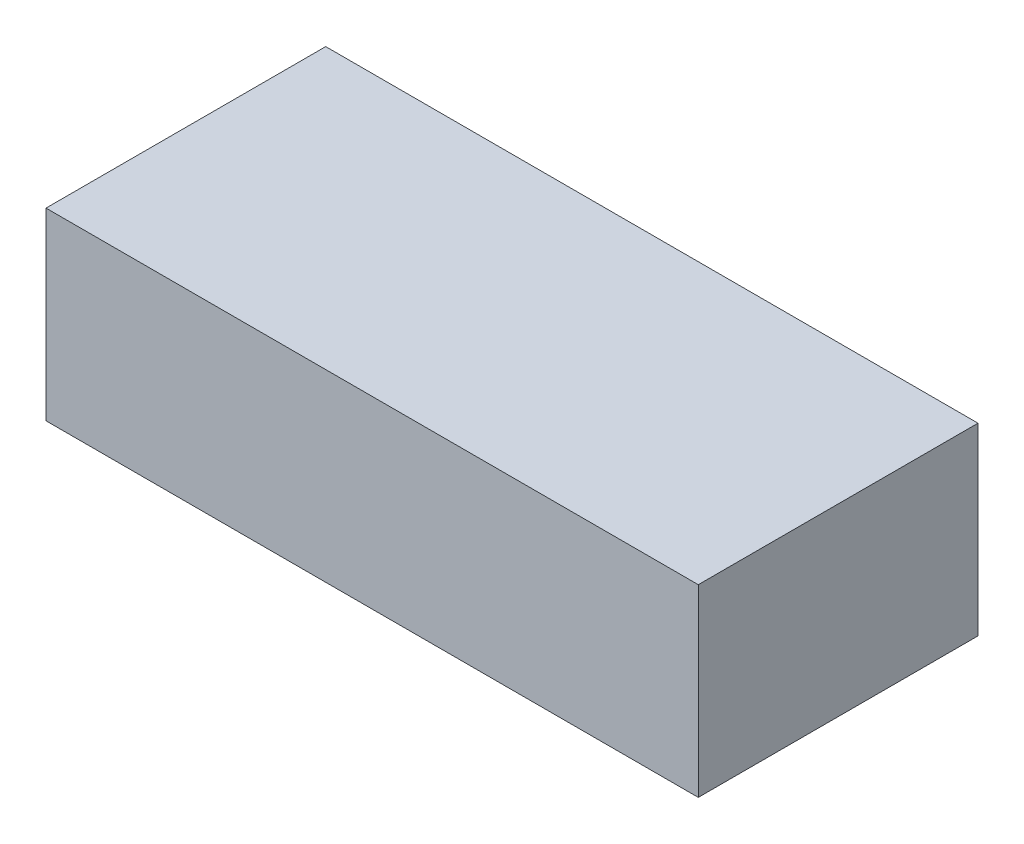
ISO-10303-21;
HEADER;
FILE_DESCRIPTION(('STEP AP214'),'2;1');
FILE_NAME('part.step','',(''),(''),'','','');
FILE_SCHEMA(('AUTOMOTIVE_DESIGN { 1 0 10303 214 1 1 1 1 }'));
ENDSEC;
DATA;
#1=APPLICATION_CONTEXT('core data for automotive mechanical design processes');
#2=APPLICATION_PROTOCOL_DEFINITION('international standard','automotive_design',2000,#1);
#3=PRODUCT_CONTEXT('',#1,'mechanical');
#4=PRODUCT('Part','Part','',(#3));
#5=PRODUCT_RELATED_PRODUCT_CATEGORY('part','',(#4));
#6=PRODUCT_DEFINITION_FORMATION('','',#4);
#7=PRODUCT_DEFINITION_CONTEXT('part definition',#1,'design');
#8=PRODUCT_DEFINITION('design','',#6,#7);
#9=PRODUCT_DEFINITION_SHAPE('','',#8);
#10=(LENGTH_UNIT() NAMED_UNIT(*) SI_UNIT(.MILLI.,.METRE.));
#11=(NAMED_UNIT(*) PLANE_ANGLE_UNIT() SI_UNIT($,.RADIAN.));
#12=(NAMED_UNIT(*) SI_UNIT($,.STERADIAN.) SOLID_ANGLE_UNIT());
#13=UNCERTAINTY_MEASURE_WITH_UNIT(LENGTH_MEASURE(1.E-05),#10,'distance_accuracy_value','');
#14=(GEOMETRIC_REPRESENTATION_CONTEXT(3) GLOBAL_UNCERTAINTY_ASSIGNED_CONTEXT((#13)) GLOBAL_UNIT_ASSIGNED_CONTEXT((#10,
#11,#12)) REPRESENTATION_CONTEXT('',''));
#15=CARTESIAN_POINT('',(0.,0.,0.));
#16=DIRECTION('',(0.,0.,1.));
#17=DIRECTION('',(1.,0.,0.));
#18=AXIS2_PLACEMENT_3D('',#15,#16,#17);
#19=CARTESIAN_POINT('',(-0.87449152,0.24699214,0.));
#20=DIRECTION('',(1.45227462341292E-06,0.999999999998946,0.));
#21=DIRECTION('',(0.999999999998946,-1.45227462341292E-06,0.));
#22=AXIS2_PLACEMENT_3D('',#19,#20,#21);
#23=PLANE('',#22);
#24=DIRECTION('',(0.,0.,1.));
#25=VECTOR('',#24,1.);
#26=CARTESIAN_POINT('',(-0.87449152,0.24699214,0.));
#27=LINE('',#26,#25);
#28=CARTESIAN_POINT('',(-0.87449152,0.24699214,0.));
#29=VERTEX_POINT('',#28);
#30=CARTESIAN_POINT('',(-0.87449152,0.24699214,0.75000104));
#31=VERTEX_POINT('',#30);
#32=EDGE_CURVE('E11',#29,#31,#27,.T.);
#33=ORIENTED_EDGE('',*,*,#32,.T.);
#34=DIRECTION('',(0.999999999998946,-1.45227462341292E-06,0.));
#35=VECTOR('',#34,1.);
#36=CARTESIAN_POINT('',(-0.87449152,0.24699214,0.75000104));
#37=LINE('',#36,#35);
#38=CARTESIAN_POINT('',(0.87448898,0.2469896,0.75000104));
#39=VERTEX_POINT('',#38);
#40=EDGE_CURVE('E23',#31,#39,#37,.T.);
#41=ORIENTED_EDGE('',*,*,#40,.T.);
#42=DIRECTION('',(0.,0.,1.));
#43=VECTOR('',#42,1.);
#44=CARTESIAN_POINT('',(0.87448898,0.2469896,0.));
#45=LINE('',#44,#43);
#46=CARTESIAN_POINT('',(0.87448898,0.2469896,0.));
#47=VERTEX_POINT('',#46);
#48=EDGE_CURVE('E84',#47,#39,#45,.T.);
#49=ORIENTED_EDGE('',*,*,#48,.F.);
#50=DIRECTION('',(0.999999999998946,-1.45227462341292E-06,0.));
#51=VECTOR('',#50,1.);
#52=CARTESIAN_POINT('',(-0.87449152,0.24699214,0.));
#53=LINE('',#52,#51);
#54=EDGE_CURVE('E82',#29,#47,#53,.T.);
#55=ORIENTED_EDGE('',*,*,#54,.F.);
#56=EDGE_LOOP('',(#33,#41,#49,#55));
#57=FACE_BOUND('',#56,.T.);
#58=ADVANCED_FACE('F16',(#57),#23,.T.);
#59=CARTESIAN_POINT('',(0.87448898,0.2469896,0.));
#60=DIRECTION('',(0.999999999986781,5.14189046130187E-06,0.));
#61=DIRECTION('',(5.14189046130187E-06,-0.999999999986781,0.));
#62=AXIS2_PLACEMENT_3D('',#59,#60,#61);
#63=PLANE('',#62);
#64=ORIENTED_EDGE('',*,*,#48,.T.);
#65=DIRECTION('',(5.14189046130187E-06,-0.999999999986781,0.));
#66=VECTOR('',#65,1.);
#67=CARTESIAN_POINT('',(0.87448898,0.2469896,0.75000104));
#68=LINE('',#67,#66);
#69=CARTESIAN_POINT('',(0.87449152,-0.24699214,0.75000104));
#70=VERTEX_POINT('',#69);
#71=EDGE_CURVE('E80',#39,#70,#68,.T.);
#72=ORIENTED_EDGE('',*,*,#71,.T.);
#73=DIRECTION('',(0.,0.,1.));
#74=VECTOR('',#73,1.);
#75=CARTESIAN_POINT('',(0.87449152,-0.24699214,0.));
#76=LINE('',#75,#74);
#77=CARTESIAN_POINT('',(0.87449152,-0.24699214,0.));
#78=VERTEX_POINT('',#77);
#79=EDGE_CURVE('E78',#78,#70,#76,.T.);
#80=ORIENTED_EDGE('',*,*,#79,.F.);
#81=DIRECTION('',(5.14189046130187E-06,-0.999999999986781,0.));
#82=VECTOR('',#81,1.);
#83=CARTESIAN_POINT('',(0.87448898,0.2469896,0.));
#84=LINE('',#83,#82);
#85=EDGE_CURVE('E69',#47,#78,#84,.T.);
#86=ORIENTED_EDGE('',*,*,#85,.F.);
#87=EDGE_LOOP('',(#64,#72,#80,#86));
#88=FACE_BOUND('',#87,.T.);
#89=ADVANCED_FACE('F89',(#88),#63,.T.);
#90=CARTESIAN_POINT('',(0.87449152,-0.24699214,0.));
#91=DIRECTION('',(0.,-1.,0.));
#92=DIRECTION('',(-1.,0.,0.));
#93=AXIS2_PLACEMENT_3D('',#90,#91,#92);
#94=PLANE('',#93);
#95=ORIENTED_EDGE('',*,*,#79,.T.);
#96=DIRECTION('',(-1.,0.,0.));
#97=VECTOR('',#96,1.);
#98=CARTESIAN_POINT('',(0.87449152,-0.24699214,0.75000104));
#99=LINE('',#98,#97);
#100=CARTESIAN_POINT('',(-0.87449152,-0.24699214,0.75000104));
#101=VERTEX_POINT('',#100);
#102=EDGE_CURVE('E59',#70,#101,#99,.T.);
#103=ORIENTED_EDGE('',*,*,#102,.T.);
#104=DIRECTION('',(0.,0.,1.));
#105=VECTOR('',#104,1.);
#106=CARTESIAN_POINT('',(-0.87449152,-0.24699214,0.));
#107=LINE('',#106,#105);
#108=CARTESIAN_POINT('',(-0.87449152,-0.24699214,0.));
#109=VERTEX_POINT('',#108);
#110=EDGE_CURVE('E53',#109,#101,#107,.T.);
#111=ORIENTED_EDGE('',*,*,#110,.F.);
#112=DIRECTION('',(-1.,0.,0.));
#113=VECTOR('',#112,1.);
#114=CARTESIAN_POINT('',(0.87449152,-0.24699214,0.));
#115=LINE('',#114,#113);
#116=EDGE_CURVE('E57',#78,#109,#115,.T.);
#117=ORIENTED_EDGE('',*,*,#116,.F.);
#118=EDGE_LOOP('',(#95,#103,#111,#117));
#119=FACE_BOUND('',#118,.T.);
#120=ADVANCED_FACE('F56',(#119),#94,.T.);
#121=CARTESIAN_POINT('',(-0.87449152,-0.24699214,0.));
#122=DIRECTION('',(-1.,0.,0.));
#123=DIRECTION('',(0.,1.,0.));
#124=AXIS2_PLACEMENT_3D('',#121,#122,#123);
#125=PLANE('',#124);
#126=ORIENTED_EDGE('',*,*,#110,.T.);
#127=DIRECTION('',(0.,1.,0.));
#128=VECTOR('',#127,1.);
#129=CARTESIAN_POINT('',(-0.87449152,-0.24699214,0.75000104));
#130=LINE('',#129,#128);
#131=EDGE_CURVE('E70',#101,#31,#130,.T.);
#132=ORIENTED_EDGE('',*,*,#131,.T.);
#133=ORIENTED_EDGE('',*,*,#32,.F.);
#134=DIRECTION('',(0.,1.,0.));
#135=VECTOR('',#134,1.);
#136=CARTESIAN_POINT('',(-0.87449152,-0.24699214,0.));
#137=LINE('',#136,#135);
#138=EDGE_CURVE('E67',#109,#29,#137,.T.);
#139=ORIENTED_EDGE('',*,*,#138,.F.);
#140=EDGE_LOOP('',(#126,#132,#133,#139));
#141=FACE_BOUND('',#140,.T.);
#142=ADVANCED_FACE('F72',(#141),#125,.T.);
#143=CARTESIAN_POINT('',(-0.87449152,0.24699214,0.));
#144=DIRECTION('',(0.,0.,1.));
#145=DIRECTION('',(1.,0.,0.));
#146=AXIS2_PLACEMENT_3D('',#143,#144,#145);
#147=PLANE('',#146);
#148=ORIENTED_EDGE('',*,*,#54,.T.);
#149=ORIENTED_EDGE('',*,*,#85,.T.);
#150=ORIENTED_EDGE('',*,*,#116,.T.);
#151=ORIENTED_EDGE('',*,*,#138,.T.);
#152=EDGE_LOOP('',(#148,#149,#150,#151));
#153=FACE_BOUND('',#152,.T.);
#154=ADVANCED_FACE('F66',(#153),#147,.F.);
#155=CARTESIAN_POINT('',(-0.87449152,0.24699214,0.75000104));
#156=DIRECTION('',(0.,0.,1.));
#157=DIRECTION('',(1.,0.,0.));
#158=AXIS2_PLACEMENT_3D('',#155,#156,#157);
#159=PLANE('',#158);
#160=ORIENTED_EDGE('',*,*,#131,.F.);
#161=ORIENTED_EDGE('',*,*,#102,.F.);
#162=ORIENTED_EDGE('',*,*,#71,.F.);
#163=ORIENTED_EDGE('',*,*,#40,.F.);
#164=EDGE_LOOP('',(#160,#161,#162,#163));
#165=FACE_BOUND('',#164,.T.);
#166=ADVANCED_FACE('F90',(#165),#159,.T.);
#167=CLOSED_SHELL('',(#58,#89,#120,#142,#154,#166));
#168=MANIFOLD_SOLID_BREP('B1',#167);
#169=ADVANCED_BREP_SHAPE_REPRESENTATION('',(#18,#168),#14);
#170=SHAPE_DEFINITION_REPRESENTATION(#9,#169);
ENDSEC;
END-ISO-10303-21;
